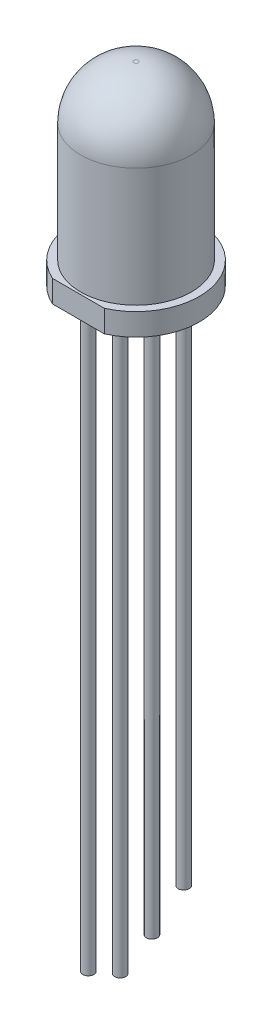
ISO-10303-21;
HEADER;
FILE_DESCRIPTION(('STEP AP214'),'2;1');
FILE_NAME('part.step','',(''),(''),'','','');
FILE_SCHEMA(('AUTOMOTIVE_DESIGN { 1 0 10303 214 1 1 1 1 }'));
ENDSEC;
DATA;
#1=APPLICATION_CONTEXT('core data for automotive mechanical design processes');
#2=APPLICATION_PROTOCOL_DEFINITION('international standard','automotive_design',2000,#1);
#3=PRODUCT_CONTEXT('',#1,'mechanical');
#4=PRODUCT('Part','Part','',(#3));
#5=PRODUCT_RELATED_PRODUCT_CATEGORY('part','',(#4));
#6=PRODUCT_DEFINITION_FORMATION('','',#4);
#7=PRODUCT_DEFINITION_CONTEXT('part definition',#1,'design');
#8=PRODUCT_DEFINITION('design','',#6,#7);
#9=PRODUCT_DEFINITION_SHAPE('','',#8);
#10=(LENGTH_UNIT() NAMED_UNIT(*) SI_UNIT(.MILLI.,.METRE.));
#11=(NAMED_UNIT(*) PLANE_ANGLE_UNIT() SI_UNIT($,.RADIAN.));
#12=(NAMED_UNIT(*) SI_UNIT($,.STERADIAN.) SOLID_ANGLE_UNIT());
#13=UNCERTAINTY_MEASURE_WITH_UNIT(LENGTH_MEASURE(1.E-05),#10,'distance_accuracy_value','');
#14=(GEOMETRIC_REPRESENTATION_CONTEXT(3) GLOBAL_UNCERTAINTY_ASSIGNED_CONTEXT((#13)) GLOBAL_UNIT_ASSIGNED_CONTEXT((#10,
#11,#12)) REPRESENTATION_CONTEXT('',''));
#15=CARTESIAN_POINT('',(0.,0.,0.));
#16=DIRECTION('',(0.,0.,1.));
#17=DIRECTION('',(1.,0.,0.));
#18=AXIS2_PLACEMENT_3D('',#15,#16,#17);
#19=CARTESIAN_POINT('',(0.,0.,0.));
#20=DIRECTION('',(0.,-1.,0.));
#21=DIRECTION('',(0.,0.,-1.));
#22=AXIS2_PLACEMENT_3D('',#19,#20,#21);
#23=PLANE('',#22);
#24=CARTESIAN_POINT('',(0.,0.,0.716666666666667));
#25=DIRECTION('',(0.,-1.,0.));
#26=DIRECTION('',(0.,0.,-1.));
#27=AXIS2_PLACEMENT_3D('',#24,#25,#26);
#28=CIRCLE('',#27,0.25);
#29=CARTESIAN_POINT('',(0.,0.,0.466666666666667));
#30=VERTEX_POINT('',#29);
#31=EDGE_CURVE('E97',#30,#30,#28,.T.);
#32=ORIENTED_EDGE('',*,*,#31,.F.);
#33=EDGE_LOOP('',(#32));
#34=FACE_BOUND('',#33,.T.);
#35=CARTESIAN_POINT('',(0.,0.,-0.716666666666667));
#36=DIRECTION('',(0.,-1.,0.));
#37=DIRECTION('',(0.,0.,-1.));
#38=AXIS2_PLACEMENT_3D('',#35,#36,#37);
#39=CIRCLE('',#38,0.25);
#40=CARTESIAN_POINT('',(0.,0.,-0.966666666666667));
#41=VERTEX_POINT('',#40);
#42=EDGE_CURVE('E94',#41,#41,#39,.T.);
#43=ORIENTED_EDGE('',*,*,#42,.F.);
#44=EDGE_LOOP('',(#43));
#45=FACE_BOUND('',#44,.T.);
#46=CARTESIAN_POINT('',(0.,0.,2.15));
#47=DIRECTION('',(0.,-1.,0.));
#48=DIRECTION('',(0.,0.,-1.));
#49=AXIS2_PLACEMENT_3D('',#46,#47,#48);
#50=CIRCLE('',#49,0.25);
#51=CARTESIAN_POINT('',(0.,0.,1.9));
#52=VERTEX_POINT('',#51);
#53=EDGE_CURVE('E89',#52,#52,#50,.T.);
#54=ORIENTED_EDGE('',*,*,#53,.F.);
#55=EDGE_LOOP('',(#54));
#56=FACE_BOUND('',#55,.T.);
#57=CARTESIAN_POINT('',(0.,0.,-2.15));
#58=DIRECTION('',(0.,-1.,0.));
#59=DIRECTION('',(0.,0.,-1.));
#60=AXIS2_PLACEMENT_3D('',#57,#58,#59);
#61=CIRCLE('',#60,0.25);
#62=CARTESIAN_POINT('',(0.,0.,-2.4));
#63=VERTEX_POINT('',#62);
#64=EDGE_CURVE('E86',#63,#63,#61,.T.);
#65=ORIENTED_EDGE('',*,*,#64,.F.);
#66=EDGE_LOOP('',(#65));
#67=FACE_BOUND('',#66,.T.);
#68=DIRECTION('',(1.,0.,0.));
#69=VECTOR('',#68,1.);
#70=CARTESIAN_POINT('',(-1.16726175299288,0.,2.6));
#71=LINE('',#70,#69);
#72=CARTESIAN_POINT('',(-1.16726175299288,0.,2.6));
#73=VERTEX_POINT('',#72);
#74=CARTESIAN_POINT('',(1.16726175299288,0.,2.6));
#75=VERTEX_POINT('',#74);
#76=EDGE_CURVE('E65',#73,#75,#71,.T.);
#77=ORIENTED_EDGE('',*,*,#76,.F.);
#78=CARTESIAN_POINT('',(0.,0.,0.));
#79=DIRECTION('',(0.,-1.,0.));
#80=DIRECTION('',(0.,0.,-1.));
#81=AXIS2_PLACEMENT_3D('',#78,#79,#80);
#82=CIRCLE('',#81,2.85);
#83=EDGE_CURVE('E12',#73,#75,#82,.T.);
#84=ORIENTED_EDGE('',*,*,#83,.T.);
#85=EDGE_LOOP('',(#77,#84));
#86=FACE_BOUND('',#85,.T.);
#87=ADVANCED_FACE('F36',(#34,#45,#56,#67,#86),#23,.T.);
#88=CARTESIAN_POINT('',(0.,0.,0.));
#89=DIRECTION('',(0.,-1.,0.));
#90=DIRECTION('',(0.,0.,-1.));
#91=AXIS2_PLACEMENT_3D('',#88,#89,#90);
#92=CYLINDRICAL_SURFACE('',#91,2.85);
#93=DIRECTION('',(0.,-1.,0.));
#94=VECTOR('',#93,1.);
#95=CARTESIAN_POINT('',(1.16726175299288,3.34787137637478,2.6));
#96=LINE('',#95,#94);
#97=CARTESIAN_POINT('',(1.16726175299288,1.,2.6));
#98=VERTEX_POINT('',#97);
#99=EDGE_CURVE('E50',#98,#75,#96,.T.);
#100=ORIENTED_EDGE('',*,*,#99,.T.);
#101=ORIENTED_EDGE('',*,*,#83,.F.);
#102=DIRECTION('',(0.,-1.,0.));
#103=VECTOR('',#102,1.);
#104=CARTESIAN_POINT('',(-1.16726175299288,3.34787137637478,2.6));
#105=LINE('',#104,#103);
#106=CARTESIAN_POINT('',(-1.16726175299288,1.,2.6));
#107=VERTEX_POINT('',#106);
#108=EDGE_CURVE('E56',#107,#73,#105,.T.);
#109=ORIENTED_EDGE('',*,*,#108,.F.);
#110=CARTESIAN_POINT('',(0.,1.,0.));
#111=DIRECTION('',(0.,-1.,0.));
#112=DIRECTION('',(0.,0.,-1.));
#113=AXIS2_PLACEMENT_3D('',#110,#111,#112);
#114=CIRCLE('',#113,2.85);
#115=EDGE_CURVE('E43',#107,#98,#114,.T.);
#116=ORIENTED_EDGE('',*,*,#115,.T.);
#117=EDGE_LOOP('',(#100,#101,#109,#116));
#118=FACE_BOUND('',#117,.T.);
#119=ADVANCED_FACE('F69',(#118),#92,.T.);
#120=CARTESIAN_POINT('',(2.85,1.,0.));
#121=DIRECTION('',(0.,1.,0.));
#122=DIRECTION('',(0.,0.,1.));
#123=AXIS2_PLACEMENT_3D('',#120,#121,#122);
#124=PLANE('',#123);
#125=DIRECTION('',(1.,0.,0.));
#126=VECTOR('',#125,1.);
#127=CARTESIAN_POINT('',(-1.16726175299288,1.,2.6));
#128=LINE('',#127,#126);
#129=EDGE_CURVE('E60',#107,#98,#128,.T.);
#130=ORIENTED_EDGE('',*,*,#129,.T.);
#131=ORIENTED_EDGE('',*,*,#115,.F.);
#132=EDGE_LOOP('',(#130,#131));
#133=FACE_BOUND('',#132,.T.);
#134=CARTESIAN_POINT('',(0.,1.,0.));
#135=DIRECTION('',(0.,-1.,0.));
#136=DIRECTION('',(0.,0.,-1.));
#137=AXIS2_PLACEMENT_3D('',#134,#135,#136);
#138=CIRCLE('',#137,2.5);
#139=CARTESIAN_POINT('',(0.,1.,-2.5));
#140=VERTEX_POINT('',#139);
#141=EDGE_CURVE('E74',#140,#140,#138,.T.);
#142=ORIENTED_EDGE('',*,*,#141,.T.);
#143=EDGE_LOOP('',(#142));
#144=FACE_BOUND('',#143,.T.);
#145=ADVANCED_FACE('F72',(#133,#144),#124,.T.);
#146=CARTESIAN_POINT('',(0.,0.,0.));
#147=DIRECTION('',(0.,-1.,0.));
#148=DIRECTION('',(0.,0.,-1.));
#149=AXIS2_PLACEMENT_3D('',#146,#147,#148);
#150=CYLINDRICAL_SURFACE('',#149,2.5);
#151=CARTESIAN_POINT('',(0.,6.35,0.));
#152=DIRECTION('',(0.,-1.,0.));
#153=DIRECTION('',(0.,0.,-1.));
#154=AXIS2_PLACEMENT_3D('',#151,#152,#153);
#155=CIRCLE('',#154,2.5);
#156=CARTESIAN_POINT('',(0.,6.35,-2.5));
#157=VERTEX_POINT('',#156);
#158=EDGE_CURVE('E76',#157,#157,#155,.T.);
#159=ORIENTED_EDGE('',*,*,#158,.T.);
#160=EDGE_LOOP('',(#159));
#161=FACE_BOUND('',#160,.T.);
#162=ORIENTED_EDGE('',*,*,#141,.F.);
#163=EDGE_LOOP('',(#162));
#164=FACE_BOUND('',#163,.T.);
#165=ADVANCED_FACE('F164',(#161,#164),#150,.T.);
#166=CARTESIAN_POINT('',(0.,6.35,0.));
#167=DIRECTION('',(0.,-1.,0.));
#168=DIRECTION('',(0.,0.,-1.));
#169=AXIS2_PLACEMENT_3D('',#166,#167,#168);
#170=DEGENERATE_TOROIDAL_SURFACE('',#169,0.1,2.4,.T.);
#171=CARTESIAN_POINT('',(0.,8.75,0.));
#172=DIRECTION('',(0.,-1.,0.));
#173=DIRECTION('',(0.,0.,-1.));
#174=AXIS2_PLACEMENT_3D('',#171,#172,#173);
#175=CIRCLE('',#174,0.1);
#176=CARTESIAN_POINT('',(0.,8.75,-0.1));
#177=VERTEX_POINT('',#176);
#178=EDGE_CURVE('E70',#177,#177,#175,.T.);
#179=ORIENTED_EDGE('',*,*,#178,.T.);
#180=EDGE_LOOP('',(#179));
#181=FACE_BOUND('',#180,.T.);
#182=ORIENTED_EDGE('',*,*,#158,.F.);
#183=EDGE_LOOP('',(#182));
#184=FACE_BOUND('',#183,.T.);
#185=ADVANCED_FACE('F160',(#181,#184),#170,.T.);
#186=CARTESIAN_POINT('',(0.,8.75,0.));
#187=DIRECTION('',(0.,1.,0.));
#188=DIRECTION('',(0.,0.,1.));
#189=AXIS2_PLACEMENT_3D('',#186,#187,#188);
#190=PLANE('',#189);
#191=ORIENTED_EDGE('',*,*,#178,.F.);
#192=EDGE_LOOP('',(#191));
#193=FACE_BOUND('',#192,.T.);
#194=ADVANCED_FACE('F153',(#193),#190,.T.);
#195=CARTESIAN_POINT('',(-1.16726175299288,3.34787137637478,2.6));
#196=DIRECTION('',(0.,0.,-1.));
#197=DIRECTION('',(-1.,0.,0.));
#198=AXIS2_PLACEMENT_3D('',#195,#196,#197);
#199=PLANE('',#198);
#200=ORIENTED_EDGE('',*,*,#108,.T.);
#201=ORIENTED_EDGE('',*,*,#76,.T.);
#202=ORIENTED_EDGE('',*,*,#99,.F.);
#203=ORIENTED_EDGE('',*,*,#129,.F.);
#204=EDGE_LOOP('',(#200,#201,#202,#203));
#205=FACE_BOUND('',#204,.T.);
#206=ADVANCED_FACE('F61',(#205),#199,.F.);
#207=CARTESIAN_POINT('',(0.,-24.5,-2.15));
#208=DIRECTION('',(0.,1.,0.));
#209=DIRECTION('',(0.,0.,1.));
#210=AXIS2_PLACEMENT_3D('',#207,#208,#209);
#211=CYLINDRICAL_SURFACE('',#210,0.25);
#212=CARTESIAN_POINT('',(0.,-24.5,-2.15));
#213=DIRECTION('',(0.,-1.,0.));
#214=DIRECTION('',(0.,0.,-1.));
#215=AXIS2_PLACEMENT_3D('',#212,#213,#214);
#216=CIRCLE('',#215,0.25);
#217=CARTESIAN_POINT('',(0.,-24.5,-2.4));
#218=VERTEX_POINT('',#217);
#219=EDGE_CURVE('E85',#218,#218,#216,.T.);
#220=ORIENTED_EDGE('',*,*,#219,.F.);
#221=EDGE_LOOP('',(#220));
#222=FACE_BOUND('',#221,.T.);
#223=ORIENTED_EDGE('',*,*,#64,.T.);
#224=EDGE_LOOP('',(#223));
#225=FACE_BOUND('',#224,.T.);
#226=ADVANCED_FACE('F142',(#222,#225),#211,.T.);
#227=CARTESIAN_POINT('',(0.,-24.5,-2.15));
#228=DIRECTION('',(0.,-1.,0.));
#229=DIRECTION('',(0.,0.,-1.));
#230=AXIS2_PLACEMENT_3D('',#227,#228,#229);
#231=PLANE('',#230);
#232=ORIENTED_EDGE('',*,*,#219,.T.);
#233=EDGE_LOOP('',(#232));
#234=FACE_BOUND('',#233,.T.);
#235=ADVANCED_FACE('F144',(#234),#231,.T.);
#236=CARTESIAN_POINT('',(0.,-24.5,2.15));
#237=DIRECTION('',(0.,1.,0.));
#238=DIRECTION('',(0.,0.,1.));
#239=AXIS2_PLACEMENT_3D('',#236,#237,#238);
#240=CYLINDRICAL_SURFACE('',#239,0.25);
#241=ORIENTED_EDGE('',*,*,#53,.T.);
#242=EDGE_LOOP('',(#241));
#243=FACE_BOUND('',#242,.T.);
#244=CARTESIAN_POINT('',(0.,-25.7,2.15));
#245=DIRECTION('',(0.,-1.,0.));
#246=DIRECTION('',(0.,0.,-1.));
#247=AXIS2_PLACEMENT_3D('',#244,#245,#246);
#248=CIRCLE('',#247,0.25);
#249=CARTESIAN_POINT('',(0.,-25.7,1.9));
#250=VERTEX_POINT('',#249);
#251=EDGE_CURVE('E100',#250,#250,#248,.T.);
#252=ORIENTED_EDGE('',*,*,#251,.F.);
#253=EDGE_LOOP('',(#252));
#254=FACE_BOUND('',#253,.T.);
#255=ADVANCED_FACE('F125',(#243,#254),#240,.T.);
#256=CARTESIAN_POINT('',(0.,-24.5,-0.716666666666667));
#257=DIRECTION('',(0.,1.,0.));
#258=DIRECTION('',(0.,0.,1.));
#259=AXIS2_PLACEMENT_3D('',#256,#257,#258);
#260=CYLINDRICAL_SURFACE('',#259,0.25);
#261=ORIENTED_EDGE('',*,*,#42,.T.);
#262=EDGE_LOOP('',(#261));
#263=FACE_BOUND('',#262,.T.);
#264=CARTESIAN_POINT('',(0.,-25.7,-0.716666666666667));
#265=DIRECTION('',(0.,-1.,0.));
#266=DIRECTION('',(0.,0.,-1.));
#267=AXIS2_PLACEMENT_3D('',#264,#265,#266);
#268=CIRCLE('',#267,0.25);
#269=CARTESIAN_POINT('',(0.,-25.7,-0.966666666666667));
#270=VERTEX_POINT('',#269);
#271=EDGE_CURVE('E103',#270,#270,#268,.T.);
#272=ORIENTED_EDGE('',*,*,#271,.F.);
#273=EDGE_LOOP('',(#272));
#274=FACE_BOUND('',#273,.T.);
#275=ADVANCED_FACE('F115',(#263,#274),#260,.T.);
#276=CARTESIAN_POINT('',(0.,-24.5,0.716666666666667));
#277=DIRECTION('',(0.,1.,0.));
#278=DIRECTION('',(0.,0.,1.));
#279=AXIS2_PLACEMENT_3D('',#276,#277,#278);
#280=CYLINDRICAL_SURFACE('',#279,0.25);
#281=ORIENTED_EDGE('',*,*,#31,.T.);
#282=EDGE_LOOP('',(#281));
#283=FACE_BOUND('',#282,.T.);
#284=CARTESIAN_POINT('',(0.,-26.5,0.716666666666667));
#285=DIRECTION('',(0.,-1.,0.));
#286=DIRECTION('',(0.,0.,-1.));
#287=AXIS2_PLACEMENT_3D('',#284,#285,#286);
#288=CIRCLE('',#287,0.25);
#289=CARTESIAN_POINT('',(0.,-26.5,0.466666666666667));
#290=VERTEX_POINT('',#289);
#291=EDGE_CURVE('E106',#290,#290,#288,.T.);
#292=ORIENTED_EDGE('',*,*,#291,.F.);
#293=EDGE_LOOP('',(#292));
#294=FACE_BOUND('',#293,.T.);
#295=ADVANCED_FACE('F112',(#283,#294),#280,.T.);
#296=CARTESIAN_POINT('',(0.,-25.7,0.));
#297=DIRECTION('',(0.,-1.,0.));
#298=DIRECTION('',(0.,0.,-1.));
#299=AXIS2_PLACEMENT_3D('',#296,#297,#298);
#300=PLANE('',#299);
#301=ORIENTED_EDGE('',*,*,#251,.T.);
#302=EDGE_LOOP('',(#301));
#303=FACE_BOUND('',#302,.T.);
#304=ADVANCED_FACE('F114',(#303),#300,.T.);
#305=CARTESIAN_POINT('',(0.,-25.7,0.));
#306=DIRECTION('',(0.,-1.,0.));
#307=DIRECTION('',(0.,0.,-1.));
#308=AXIS2_PLACEMENT_3D('',#305,#306,#307);
#309=PLANE('',#308);
#310=ORIENTED_EDGE('',*,*,#271,.T.);
#311=EDGE_LOOP('',(#310));
#312=FACE_BOUND('',#311,.T.);
#313=ADVANCED_FACE('F122',(#312),#309,.T.);
#314=CARTESIAN_POINT('',(0.,-26.5,0.));
#315=DIRECTION('',(0.,-1.,0.));
#316=DIRECTION('',(0.,0.,-1.));
#317=AXIS2_PLACEMENT_3D('',#314,#315,#316);
#318=PLANE('',#317);
#319=ORIENTED_EDGE('',*,*,#291,.T.);
#320=EDGE_LOOP('',(#319));
#321=FACE_BOUND('',#320,.T.);
#322=ADVANCED_FACE('F110',(#321),#318,.T.);
#323=CLOSED_SHELL('',(#87,#119,#145,#165,#185,#194,#206,#226,#235,#255,#275,#295,#304,#313,#322));
#324=MANIFOLD_SOLID_BREP('B2',#323);
#325=ADVANCED_BREP_SHAPE_REPRESENTATION('',(#18,#324),#14);
#326=SHAPE_DEFINITION_REPRESENTATION(#9,#325);
ENDSEC;
END-ISO-10303-21;
